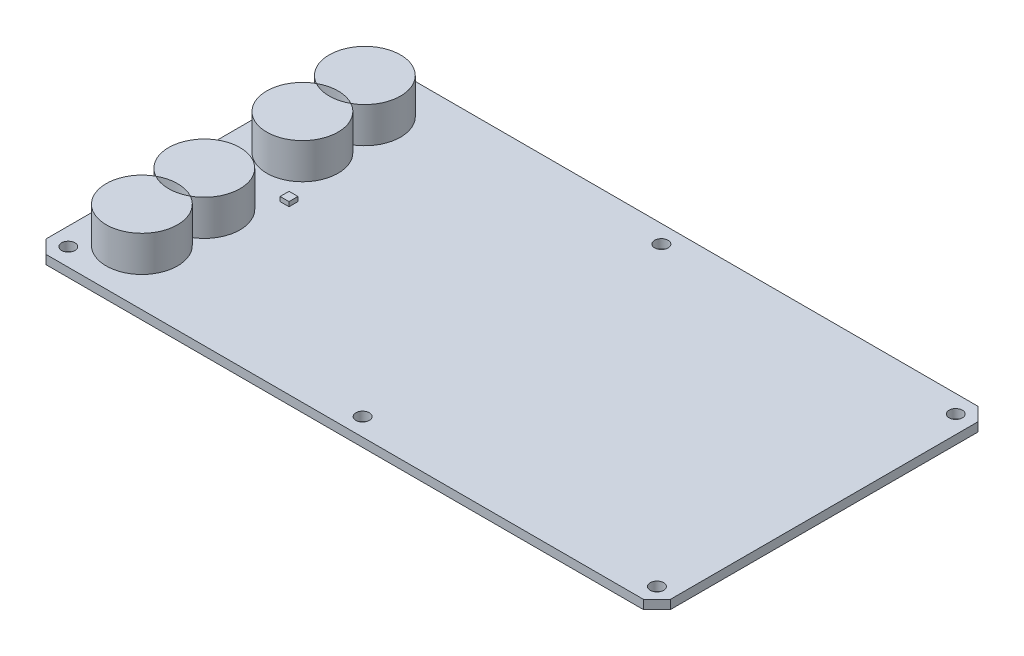
ISO-10303-21;
HEADER;
FILE_DESCRIPTION(('STEP AP214'),'2;1');
FILE_NAME('part.step','',(''),(''),'','','');
FILE_SCHEMA(('AUTOMOTIVE_DESIGN { 1 0 10303 214 1 1 1 1 }'));
ENDSEC;
DATA;
#1=APPLICATION_CONTEXT('core data for automotive mechanical design processes');
#2=APPLICATION_PROTOCOL_DEFINITION('international standard','automotive_design',2000,#1);
#3=PRODUCT_CONTEXT('',#1,'mechanical');
#4=PRODUCT('Part','Part','',(#3));
#5=PRODUCT_RELATED_PRODUCT_CATEGORY('part','',(#4));
#6=PRODUCT_DEFINITION_FORMATION('','',#4);
#7=PRODUCT_DEFINITION_CONTEXT('part definition',#1,'design');
#8=PRODUCT_DEFINITION('design','',#6,#7);
#9=PRODUCT_DEFINITION_SHAPE('','',#8);
#10=(LENGTH_UNIT() NAMED_UNIT(*) SI_UNIT(.MILLI.,.METRE.));
#11=(NAMED_UNIT(*) PLANE_ANGLE_UNIT() SI_UNIT($,.RADIAN.));
#12=(NAMED_UNIT(*) SI_UNIT($,.STERADIAN.) SOLID_ANGLE_UNIT());
#13=UNCERTAINTY_MEASURE_WITH_UNIT(LENGTH_MEASURE(1.E-05),#10,'distance_accuracy_value','');
#14=(GEOMETRIC_REPRESENTATION_CONTEXT(3) GLOBAL_UNCERTAINTY_ASSIGNED_CONTEXT((#13)) GLOBAL_UNIT_ASSIGNED_CONTEXT((#10,
#11,#12)) REPRESENTATION_CONTEXT('',''));
#15=CARTESIAN_POINT('',(0.,0.,0.));
#16=DIRECTION('',(0.,0.,1.));
#17=DIRECTION('',(1.,0.,0.));
#18=AXIS2_PLACEMENT_3D('',#15,#16,#17);
#19=CARTESIAN_POINT('',(0.,2.,0.));
#20=DIRECTION('',(0.,1.,0.));
#21=DIRECTION('',(0.,0.,1.));
#22=AXIS2_PLACEMENT_3D('',#19,#20,#21);
#23=PLANE('',#22);
#24=CARTESIAN_POINT('',(-58.,2.,-11.));
#25=DIRECTION('',(0.,-1.,0.));
#26=DIRECTION('',(0.,0.,-1.));
#27=AXIS2_PLACEMENT_3D('',#24,#25,#26);
#28=CIRCLE('',#27,8.);
#29=CARTESIAN_POINT('',(-54.1270166537926,2.,-18.));
#30=VERTEX_POINT('',#29);
#31=CARTESIAN_POINT('',(-61.8729833462074,2.,-18.));
#32=VERTEX_POINT('',#31);
#33=EDGE_CURVE('P0_E41',#30,#32,#28,.F.);
#34=ORIENTED_EDGE('',*,*,#33,.T.);
#35=CARTESIAN_POINT('',(-58.,2.,-25.));
#36=DIRECTION('',(0.,-1.,0.));
#37=DIRECTION('',(0.,0.,-1.));
#38=AXIS2_PLACEMENT_3D('',#35,#36,#37);
#39=CIRCLE('',#38,8.);
#40=EDGE_CURVE('P0_E20',#30,#32,#39,.F.);
#41=ORIENTED_EDGE('',*,*,#40,.F.);
#42=EDGE_LOOP('',(#34,#41));
#43=FACE_BOUND('',#42,.T.);
#44=ADVANCED_FACE('P0_F17',(#43),#23,.F.);
#45=CARTESIAN_POINT('',(-58.,10.,-25.));
#46=DIRECTION('',(0.,-1.,0.));
#47=DIRECTION('',(0.,0.,-1.));
#48=AXIS2_PLACEMENT_3D('',#45,#46,#47);
#49=CYLINDRICAL_SURFACE('',#48,8.);
#50=ORIENTED_EDGE('',*,*,#40,.T.);
#51=DIRECTION('',(0.,-1.,0.));
#52=VECTOR('',#51,1.);
#53=CARTESIAN_POINT('',(-61.8729833462074,10.,-18.));
#54=LINE('',#53,#52);
#55=CARTESIAN_POINT('',(-61.8729833462074,10.,-18.));
#56=VERTEX_POINT('',#55);
#57=EDGE_CURVE('P0_E49',#32,#56,#54,.F.);
#58=ORIENTED_EDGE('',*,*,#57,.T.);
#59=CARTESIAN_POINT('',(-58.,10.,-25.));
#60=DIRECTION('',(0.,-1.,0.));
#61=DIRECTION('',(0.,0.,-1.));
#62=AXIS2_PLACEMENT_3D('',#59,#60,#61);
#63=CIRCLE('',#62,8.);
#64=CARTESIAN_POINT('',(-54.1270166537926,10.,-18.));
#65=VERTEX_POINT('',#64);
#66=EDGE_CURVE('P0_E11',#65,#56,#63,.F.);
#67=ORIENTED_EDGE('',*,*,#66,.F.);
#68=DIRECTION('',(0.,-1.,0.));
#69=VECTOR('',#68,1.);
#70=CARTESIAN_POINT('',(-54.1270166537926,10.,-18.));
#71=LINE('',#70,#69);
#72=EDGE_CURVE('P0_E46',#65,#30,#71,.T.);
#73=ORIENTED_EDGE('',*,*,#72,.T.);
#74=EDGE_LOOP('',(#50,#58,#67,#73));
#75=FACE_BOUND('',#74,.T.);
#76=ADVANCED_FACE('P0_F50',(#75),#49,.T.);
#77=CARTESIAN_POINT('',(-58.,10.,-11.));
#78=DIRECTION('',(0.,-1.,0.));
#79=DIRECTION('',(0.,0.,-1.));
#80=AXIS2_PLACEMENT_3D('',#77,#78,#79);
#81=CYLINDRICAL_SURFACE('',#80,8.);
#82=CARTESIAN_POINT('',(-58.,10.,-11.));
#83=DIRECTION('',(0.,-1.,0.));
#84=DIRECTION('',(0.,0.,-1.));
#85=AXIS2_PLACEMENT_3D('',#82,#83,#84);
#86=CIRCLE('',#85,8.);
#87=EDGE_CURVE('P0_E26',#56,#65,#86,.T.);
#88=ORIENTED_EDGE('',*,*,#87,.F.);
#89=ORIENTED_EDGE('',*,*,#57,.F.);
#90=ORIENTED_EDGE('',*,*,#33,.F.);
#91=ORIENTED_EDGE('',*,*,#72,.F.);
#92=EDGE_LOOP('',(#88,#89,#90,#91));
#93=FACE_BOUND('',#92,.T.);
#94=ADVANCED_FACE('P0_F47',(#93),#81,.F.);
#95=CARTESIAN_POINT('',(0.,10.,0.));
#96=DIRECTION('',(0.,1.,0.));
#97=DIRECTION('',(0.,0.,1.));
#98=AXIS2_PLACEMENT_3D('',#95,#96,#97);
#99=PLANE('',#98);
#100=ORIENTED_EDGE('',*,*,#66,.T.);
#101=ORIENTED_EDGE('',*,*,#87,.T.);
#102=EDGE_LOOP('',(#100,#101));
#103=FACE_BOUND('',#102,.T.);
#104=ADVANCED_FACE('P0_F55',(#103),#99,.T.);
#105=CLOSED_SHELL('',(#44,#76,#94,#104));
#106=MANIFOLD_SOLID_BREP('P0_B1',#105);
#107=CARTESIAN_POINT('',(0.,2.,0.));
#108=DIRECTION('',(0.,1.,0.));
#109=DIRECTION('',(0.,0.,1.));
#110=AXIS2_PLACEMENT_3D('',#107,#108,#109);
#111=PLANE('',#110);
#112=CARTESIAN_POINT('',(-58.,2.,25.));
#113=DIRECTION('',(0.,-1.,0.));
#114=DIRECTION('',(0.,0.,-1.));
#115=AXIS2_PLACEMENT_3D('',#112,#113,#114);
#116=CIRCLE('',#115,8.);
#117=CARTESIAN_POINT('',(-54.1270166537925,2.,18.));
#118=VERTEX_POINT('',#117);
#119=CARTESIAN_POINT('',(-61.8729833462074,2.,18.));
#120=VERTEX_POINT('',#119);
#121=EDGE_CURVE('P1_E42',#118,#120,#116,.F.);
#122=ORIENTED_EDGE('',*,*,#121,.T.);
#123=CARTESIAN_POINT('',(-58.,2.,11.));
#124=DIRECTION('',(0.,-1.,0.));
#125=DIRECTION('',(0.,0.,-1.));
#126=AXIS2_PLACEMENT_3D('',#123,#124,#125);
#127=CIRCLE('',#126,8.);
#128=EDGE_CURVE('P1_E20',#118,#120,#127,.F.);
#129=ORIENTED_EDGE('',*,*,#128,.F.);
#130=EDGE_LOOP('',(#122,#129));
#131=FACE_BOUND('',#130,.T.);
#132=ADVANCED_FACE('P1_F17',(#131),#111,.F.);
#133=CARTESIAN_POINT('',(-58.,10.,11.));
#134=DIRECTION('',(0.,-1.,0.));
#135=DIRECTION('',(0.,0.,-1.));
#136=AXIS2_PLACEMENT_3D('',#133,#134,#135);
#137=CYLINDRICAL_SURFACE('',#136,8.);
#138=ORIENTED_EDGE('',*,*,#128,.T.);
#139=DIRECTION('',(0.,-1.,0.));
#140=VECTOR('',#139,1.);
#141=CARTESIAN_POINT('',(-61.8729833462074,10.,18.));
#142=LINE('',#141,#140);
#143=CARTESIAN_POINT('',(-61.8729833462074,10.,18.));
#144=VERTEX_POINT('',#143);
#145=EDGE_CURVE('P1_E50',#120,#144,#142,.F.);
#146=ORIENTED_EDGE('',*,*,#145,.T.);
#147=CARTESIAN_POINT('',(-58.,10.,11.));
#148=DIRECTION('',(0.,-1.,0.));
#149=DIRECTION('',(0.,0.,-1.));
#150=AXIS2_PLACEMENT_3D('',#147,#148,#149);
#151=CIRCLE('',#150,8.);
#152=CARTESIAN_POINT('',(-54.1270166537925,10.,18.));
#153=VERTEX_POINT('',#152);
#154=EDGE_CURVE('P1_E11',#153,#144,#151,.F.);
#155=ORIENTED_EDGE('',*,*,#154,.F.);
#156=DIRECTION('',(0.,-1.,0.));
#157=VECTOR('',#156,1.);
#158=CARTESIAN_POINT('',(-54.1270166537925,10.,18.));
#159=LINE('',#158,#157);
#160=EDGE_CURVE('P1_E47',#153,#118,#159,.T.);
#161=ORIENTED_EDGE('',*,*,#160,.T.);
#162=EDGE_LOOP('',(#138,#146,#155,#161));
#163=FACE_BOUND('',#162,.T.);
#164=ADVANCED_FACE('P1_F51',(#163),#137,.T.);
#165=CARTESIAN_POINT('',(-58.,10.,25.));
#166=DIRECTION('',(0.,-1.,0.));
#167=DIRECTION('',(0.,0.,-1.));
#168=AXIS2_PLACEMENT_3D('',#165,#166,#167);
#169=CYLINDRICAL_SURFACE('',#168,8.);
#170=CARTESIAN_POINT('',(-58.,10.,25.));
#171=DIRECTION('',(0.,-1.,0.));
#172=DIRECTION('',(0.,0.,-1.));
#173=AXIS2_PLACEMENT_3D('',#170,#171,#172);
#174=CIRCLE('',#173,8.);
#175=EDGE_CURVE('P1_E27',#144,#153,#174,.T.);
#176=ORIENTED_EDGE('',*,*,#175,.F.);
#177=ORIENTED_EDGE('',*,*,#145,.F.);
#178=ORIENTED_EDGE('',*,*,#121,.F.);
#179=ORIENTED_EDGE('',*,*,#160,.F.);
#180=EDGE_LOOP('',(#176,#177,#178,#179));
#181=FACE_BOUND('',#180,.T.);
#182=ADVANCED_FACE('P1_F48',(#181),#169,.F.);
#183=CARTESIAN_POINT('',(0.,10.,0.));
#184=DIRECTION('',(0.,1.,0.));
#185=DIRECTION('',(0.,0.,1.));
#186=AXIS2_PLACEMENT_3D('',#183,#184,#185);
#187=PLANE('',#186);
#188=ORIENTED_EDGE('',*,*,#154,.T.);
#189=ORIENTED_EDGE('',*,*,#175,.T.);
#190=EDGE_LOOP('',(#188,#189));
#191=FACE_BOUND('',#190,.T.);
#192=ADVANCED_FACE('P1_F56',(#191),#187,.T.);
#193=CLOSED_SHELL('',(#132,#164,#182,#192));
#194=MANIFOLD_SOLID_BREP('P1_B1',#193);
#195=CARTESIAN_POINT('',(0.,2.,0.));
#196=DIRECTION('',(0.,-1.,0.));
#197=DIRECTION('',(0.,0.,-1.));
#198=AXIS2_PLACEMENT_3D('',#195,#196,#197);
#199=PLANE('',#198);
#200=DIRECTION('',(0.,0.,-1.));
#201=VECTOR('',#200,1.);
#202=CARTESIAN_POINT('',(-51.,2.,0.999999999999998));
#203=LINE('',#202,#201);
#204=CARTESIAN_POINT('',(-51.,2.,0.999999999999998));
#205=VERTEX_POINT('',#204);
#206=CARTESIAN_POINT('',(-51.,2.,-0.999999999999967));
#207=VERTEX_POINT('',#206);
#208=EDGE_CURVE('P2_E55',#205,#207,#203,.T.);
#209=ORIENTED_EDGE('',*,*,#208,.T.);
#210=DIRECTION('',(1.,0.,0.));
#211=VECTOR('',#210,1.);
#212=CARTESIAN_POINT('',(-51.,2.,-0.999999999999967));
#213=LINE('',#212,#211);
#214=CARTESIAN_POINT('',(-49.,2.,-0.999999999999967));
#215=VERTEX_POINT('',#214);
#216=EDGE_CURVE('P2_E76',#207,#215,#213,.T.);
#217=ORIENTED_EDGE('',*,*,#216,.T.);
#218=DIRECTION('',(0.,0.,1.));
#219=VECTOR('',#218,1.);
#220=CARTESIAN_POINT('',(-49.,2.,0.999999999999998));
#221=LINE('',#220,#219);
#222=CARTESIAN_POINT('',(-49.,2.,0.999999999999998));
#223=VERTEX_POINT('',#222);
#224=EDGE_CURVE('P2_E58',#215,#223,#221,.T.);
#225=ORIENTED_EDGE('',*,*,#224,.T.);
#226=DIRECTION('',(-1.,0.,0.));
#227=VECTOR('',#226,1.);
#228=CARTESIAN_POINT('',(-51.,2.,0.999999999999998));
#229=LINE('',#228,#227);
#230=EDGE_CURVE('P2_E20',#223,#205,#229,.T.);
#231=ORIENTED_EDGE('',*,*,#230,.T.);
#232=EDGE_LOOP('',(#209,#217,#225,#231));
#233=FACE_BOUND('',#232,.T.);
#234=ADVANCED_FACE('P2_F17',(#233),#199,.T.);
#235=CARTESIAN_POINT('',(-51.,3.,0.999999999999998));
#236=DIRECTION('',(0.,0.,-1.));
#237=DIRECTION('',(-1.,0.,0.));
#238=AXIS2_PLACEMENT_3D('',#235,#236,#237);
#239=PLANE('',#238);
#240=DIRECTION('',(0.,1.,0.));
#241=VECTOR('',#240,1.);
#242=CARTESIAN_POINT('',(-49.,3.,0.999999999999998));
#243=LINE('',#242,#241);
#244=CARTESIAN_POINT('',(-49.,3.,0.999999999999998));
#245=VERTEX_POINT('',#244);
#246=EDGE_CURVE('P2_E78',#223,#245,#243,.T.);
#247=ORIENTED_EDGE('',*,*,#246,.T.);
#248=DIRECTION('',(1.,0.,0.));
#249=VECTOR('',#248,1.);
#250=CARTESIAN_POINT('',(0.,3.,0.999999999999998));
#251=LINE('',#250,#249);
#252=CARTESIAN_POINT('',(-51.,3.,0.999999999999998));
#253=VERTEX_POINT('',#252);
#254=EDGE_CURVE('P2_E73',#245,#253,#251,.F.);
#255=ORIENTED_EDGE('',*,*,#254,.T.);
#256=DIRECTION('',(0.,1.,0.));
#257=VECTOR('',#256,1.);
#258=CARTESIAN_POINT('',(-51.,3.,0.999999999999998));
#259=LINE('',#258,#257);
#260=EDGE_CURVE('P2_E63',#253,#205,#259,.F.);
#261=ORIENTED_EDGE('',*,*,#260,.T.);
#262=ORIENTED_EDGE('',*,*,#230,.F.);
#263=EDGE_LOOP('',(#247,#255,#261,#262));
#264=FACE_BOUND('',#263,.T.);
#265=ADVANCED_FACE('P2_F72',(#264),#239,.F.);
#266=CARTESIAN_POINT('',(-51.,3.,0.999999999999998));
#267=DIRECTION('',(1.,0.,0.));
#268=DIRECTION('',(0.,0.,-1.));
#269=AXIS2_PLACEMENT_3D('',#266,#267,#268);
#270=PLANE('',#269);
#271=ORIENTED_EDGE('',*,*,#260,.F.);
#272=DIRECTION('',(0.,0.,-1.));
#273=VECTOR('',#272,1.);
#274=CARTESIAN_POINT('',(-51.,3.,0.));
#275=LINE('',#274,#273);
#276=CARTESIAN_POINT('',(-51.,3.,-0.999999999999967));
#277=VERTEX_POINT('',#276);
#278=EDGE_CURVE('P2_E83',#253,#277,#275,.T.);
#279=ORIENTED_EDGE('',*,*,#278,.T.);
#280=DIRECTION('',(0.,1.,0.));
#281=VECTOR('',#280,1.);
#282=CARTESIAN_POINT('',(-51.,3.,-0.999999999999967));
#283=LINE('',#282,#281);
#284=EDGE_CURVE('P2_E69',#277,#207,#283,.F.);
#285=ORIENTED_EDGE('',*,*,#284,.T.);
#286=ORIENTED_EDGE('',*,*,#208,.F.);
#287=EDGE_LOOP('',(#271,#279,#285,#286));
#288=FACE_BOUND('',#287,.T.);
#289=ADVANCED_FACE('P2_F66',(#288),#270,.F.);
#290=CARTESIAN_POINT('',(-51.,3.,-0.999999999999967));
#291=DIRECTION('',(0.,0.,1.));
#292=DIRECTION('',(1.,0.,0.));
#293=AXIS2_PLACEMENT_3D('',#290,#291,#292);
#294=PLANE('',#293);
#295=ORIENTED_EDGE('',*,*,#284,.F.);
#296=DIRECTION('',(1.,0.,0.));
#297=VECTOR('',#296,1.);
#298=CARTESIAN_POINT('',(0.,3.,-0.999999999999967));
#299=LINE('',#298,#297);
#300=CARTESIAN_POINT('',(-49.,3.,-0.999999999999967));
#301=VERTEX_POINT('',#300);
#302=EDGE_CURVE('P2_E26',#277,#301,#299,.T.);
#303=ORIENTED_EDGE('',*,*,#302,.T.);
#304=DIRECTION('',(0.,1.,0.));
#305=VECTOR('',#304,1.);
#306=CARTESIAN_POINT('',(-49.,3.,-0.999999999999967));
#307=LINE('',#306,#305);
#308=EDGE_CURVE('P2_E34',#301,#215,#307,.F.);
#309=ORIENTED_EDGE('',*,*,#308,.T.);
#310=ORIENTED_EDGE('',*,*,#216,.F.);
#311=EDGE_LOOP('',(#295,#303,#309,#310));
#312=FACE_BOUND('',#311,.T.);
#313=ADVANCED_FACE('P2_F88',(#312),#294,.F.);
#314=CARTESIAN_POINT('',(-49.,3.,0.999999999999998));
#315=DIRECTION('',(-1.,0.,0.));
#316=DIRECTION('',(0.,0.,1.));
#317=AXIS2_PLACEMENT_3D('',#314,#315,#316);
#318=PLANE('',#317);
#319=ORIENTED_EDGE('',*,*,#308,.F.);
#320=DIRECTION('',(0.,0.,-1.));
#321=VECTOR('',#320,1.);
#322=CARTESIAN_POINT('',(-49.,3.,0.));
#323=LINE('',#322,#321);
#324=EDGE_CURVE('P2_E10',#301,#245,#323,.F.);
#325=ORIENTED_EDGE('',*,*,#324,.T.);
#326=ORIENTED_EDGE('',*,*,#246,.F.);
#327=ORIENTED_EDGE('',*,*,#224,.F.);
#328=EDGE_LOOP('',(#319,#325,#326,#327));
#329=FACE_BOUND('',#328,.T.);
#330=ADVANCED_FACE('P2_F91',(#329),#318,.F.);
#331=CARTESIAN_POINT('',(0.,3.,0.));
#332=DIRECTION('',(0.,-1.,0.));
#333=DIRECTION('',(0.,0.,-1.));
#334=AXIS2_PLACEMENT_3D('',#331,#332,#333);
#335=PLANE('',#334);
#336=ORIENTED_EDGE('',*,*,#302,.F.);
#337=ORIENTED_EDGE('',*,*,#278,.F.);
#338=ORIENTED_EDGE('',*,*,#254,.F.);
#339=ORIENTED_EDGE('',*,*,#324,.F.);
#340=EDGE_LOOP('',(#336,#337,#338,#339));
#341=FACE_BOUND('',#340,.T.);
#342=ADVANCED_FACE('P2_F90',(#341),#335,.F.);
#343=CLOSED_SHELL('',(#234,#265,#289,#313,#330,#342));
#344=MANIFOLD_SOLID_BREP('P2_B1',#343);
#345=CARTESIAN_POINT('',(0.,0.,0.));
#346=DIRECTION('',(0.,1.,0.));
#347=DIRECTION('',(0.,0.,1.));
#348=AXIS2_PLACEMENT_3D('',#345,#346,#347);
#349=PLANE('',#348);
#350=CARTESIAN_POINT('',(0.,0.,33.5));
#351=DIRECTION('',(0.,-1.,0.));
#352=DIRECTION('',(0.,0.,-1.));
#353=AXIS2_PLACEMENT_3D('',#350,#351,#352);
#354=CIRCLE('',#353,1.5);
#355=CARTESIAN_POINT('',(0.,0.,32.));
#356=VERTEX_POINT('',#355);
#357=EDGE_CURVE('P3_E122',#356,#356,#354,.F.);
#358=ORIENTED_EDGE('',*,*,#357,.T.);
#359=EDGE_LOOP('',(#358));
#360=FACE_BOUND('',#359,.T.);
#361=CARTESIAN_POINT('',(0.,0.,-33.5));
#362=DIRECTION('',(0.,-1.,0.));
#363=DIRECTION('',(0.,0.,-1.));
#364=AXIS2_PLACEMENT_3D('',#361,#362,#363);
#365=CIRCLE('',#364,1.5);
#366=CARTESIAN_POINT('',(0.,0.,-35.));
#367=VERTEX_POINT('',#366);
#368=EDGE_CURVE('P3_E19',#367,#367,#365,.F.);
#369=ORIENTED_EDGE('',*,*,#368,.T.);
#370=EDGE_LOOP('',(#369));
#371=FACE_BOUND('',#370,.T.);
#372=CARTESIAN_POINT('',(66.,0.,33.5));
#373=DIRECTION('',(0.,-1.,0.));
#374=DIRECTION('',(0.,0.,-1.));
#375=AXIS2_PLACEMENT_3D('',#372,#373,#374);
#376=CIRCLE('',#375,1.49999999999999);
#377=CARTESIAN_POINT('',(66.,0.,32.));
#378=VERTEX_POINT('',#377);
#379=EDGE_CURVE('P3_E125',#378,#378,#376,.F.);
#380=ORIENTED_EDGE('',*,*,#379,.T.);
#381=EDGE_LOOP('',(#380));
#382=FACE_BOUND('',#381,.T.);
#383=CARTESIAN_POINT('',(66.,0.,-33.5));
#384=DIRECTION('',(0.,-1.,0.));
#385=DIRECTION('',(0.,0.,-1.));
#386=AXIS2_PLACEMENT_3D('',#383,#384,#385);
#387=CIRCLE('',#386,1.49999999999999);
#388=CARTESIAN_POINT('',(66.,0.,-35.));
#389=VERTEX_POINT('',#388);
#390=EDGE_CURVE('P3_E133',#389,#389,#387,.F.);
#391=ORIENTED_EDGE('',*,*,#390,.T.);
#392=EDGE_LOOP('',(#391));
#393=FACE_BOUND('',#392,.T.);
#394=CARTESIAN_POINT('',(-66.,0.,-33.5));
#395=DIRECTION('',(0.,-1.,0.));
#396=DIRECTION('',(0.,0.,-1.));
#397=AXIS2_PLACEMENT_3D('',#394,#395,#396);
#398=CIRCLE('',#397,1.49999999999999);
#399=CARTESIAN_POINT('',(-66.,0.,-35.));
#400=VERTEX_POINT('',#399);
#401=EDGE_CURVE('P3_E128',#400,#400,#398,.F.);
#402=ORIENTED_EDGE('',*,*,#401,.T.);
#403=EDGE_LOOP('',(#402));
#404=FACE_BOUND('',#403,.T.);
#405=CARTESIAN_POINT('',(-66.,0.,33.5));
#406=DIRECTION('',(0.,-1.,0.));
#407=DIRECTION('',(0.,0.,-1.));
#408=AXIS2_PLACEMENT_3D('',#405,#406,#407);
#409=CIRCLE('',#408,1.49999999999999);
#410=CARTESIAN_POINT('',(-66.,0.,32.));
#411=VERTEX_POINT('',#410);
#412=EDGE_CURVE('P3_E92',#411,#411,#409,.F.);
#413=ORIENTED_EDGE('',*,*,#412,.T.);
#414=EDGE_LOOP('',(#413));
#415=FACE_BOUND('',#414,.T.);
#416=DIRECTION('',(0.707106781186548,0.,0.707106781186548));
#417=VECTOR('',#416,1.);
#418=CARTESIAN_POINT('',(70.,0.,-34.5));
#419=LINE('',#418,#417);
#420=CARTESIAN_POINT('',(67.,0.,-37.5));
#421=VERTEX_POINT('',#420);
#422=CARTESIAN_POINT('',(70.,0.,-34.5));
#423=VERTEX_POINT('',#422);
#424=EDGE_CURVE('P3_E131',#421,#423,#419,.T.);
#425=ORIENTED_EDGE('',*,*,#424,.T.);
#426=DIRECTION('',(0.,0.,1.));
#427=VECTOR('',#426,1.);
#428=CARTESIAN_POINT('',(70.,0.,34.5));
#429=LINE('',#428,#427);
#430=CARTESIAN_POINT('',(70.,0.,34.5));
#431=VERTEX_POINT('',#430);
#432=EDGE_CURVE('P3_E408',#423,#431,#429,.T.);
#433=ORIENTED_EDGE('',*,*,#432,.T.);
#434=DIRECTION('',(-0.707106781186548,0.,0.707106781186548));
#435=VECTOR('',#434,1.);
#436=CARTESIAN_POINT('',(67.,0.,37.5));
#437=LINE('',#436,#435);
#438=CARTESIAN_POINT('',(67.,0.,37.5));
#439=VERTEX_POINT('',#438);
#440=EDGE_CURVE('P3_E413',#431,#439,#437,.T.);
#441=ORIENTED_EDGE('',*,*,#440,.T.);
#442=DIRECTION('',(-1.,0.,0.));
#443=VECTOR('',#442,1.);
#444=CARTESIAN_POINT('',(-67.,0.,37.5));
#445=LINE('',#444,#443);
#446=CARTESIAN_POINT('',(-67.,0.,37.5));
#447=VERTEX_POINT('',#446);
#448=EDGE_CURVE('P3_E418',#439,#447,#445,.T.);
#449=ORIENTED_EDGE('',*,*,#448,.T.);
#450=DIRECTION('',(-0.707106781186548,0.,-0.707106781186548));
#451=VECTOR('',#450,1.);
#452=CARTESIAN_POINT('',(-67.,0.,37.5));
#453=LINE('',#452,#451);
#454=CARTESIAN_POINT('',(-70.,0.,34.5));
#455=VERTEX_POINT('',#454);
#456=EDGE_CURVE('P3_E388',#447,#455,#453,.T.);
#457=ORIENTED_EDGE('',*,*,#456,.T.);
#458=DIRECTION('',(0.,0.,-1.));
#459=VECTOR('',#458,1.);
#460=CARTESIAN_POINT('',(-70.,0.,34.5));
#461=LINE('',#460,#459);
#462=CARTESIAN_POINT('',(-70.,0.,-34.5));
#463=VERTEX_POINT('',#462);
#464=EDGE_CURVE('P3_E95',#455,#463,#461,.T.);
#465=ORIENTED_EDGE('',*,*,#464,.T.);
#466=DIRECTION('',(0.707106781186548,0.,-0.707106781186548));
#467=VECTOR('',#466,1.);
#468=CARTESIAN_POINT('',(-70.,0.,-34.5));
#469=LINE('',#468,#467);
#470=CARTESIAN_POINT('',(-67.,0.,-37.5));
#471=VERTEX_POINT('',#470);
#472=EDGE_CURVE('P3_E78',#463,#471,#469,.T.);
#473=ORIENTED_EDGE('',*,*,#472,.T.);
#474=DIRECTION('',(1.,0.,0.));
#475=VECTOR('',#474,1.);
#476=CARTESIAN_POINT('',(-67.,0.,-37.5));
#477=LINE('',#476,#475);
#478=EDGE_CURVE('P3_E83',#471,#421,#477,.T.);
#479=ORIENTED_EDGE('',*,*,#478,.T.);
#480=EDGE_LOOP('',(#425,#433,#441,#449,#457,#465,#473,#479));
#481=FACE_BOUND('',#480,.T.);
#482=ADVANCED_FACE('P3_F16',(#360,#371,#382,#393,#404,#415,#481),#349,.F.);
#483=CARTESIAN_POINT('',(0.,2.,-33.5));
#484=DIRECTION('',(0.,-1.,0.));
#485=DIRECTION('',(0.,0.,-1.));
#486=AXIS2_PLACEMENT_3D('',#483,#484,#485);
#487=CYLINDRICAL_SURFACE('',#486,1.5);
#488=CARTESIAN_POINT('',(0.,2.,-33.5));
#489=DIRECTION('',(0.,-1.,0.));
#490=DIRECTION('',(0.,0.,-1.));
#491=AXIS2_PLACEMENT_3D('',#488,#489,#490);
#492=CIRCLE('',#491,1.5);
#493=CARTESIAN_POINT('',(0.,2.,-35.));
#494=VERTEX_POINT('',#493);
#495=EDGE_CURVE('P3_E119',#494,#494,#492,.T.);
#496=ORIENTED_EDGE('',*,*,#495,.F.);
#497=EDGE_LOOP('',(#496));
#498=FACE_BOUND('',#497,.T.);
#499=ORIENTED_EDGE('',*,*,#368,.F.);
#500=EDGE_LOOP('',(#499));
#501=FACE_BOUND('',#500,.T.);
#502=ADVANCED_FACE('P3_F142',(#498,#501),#487,.F.);
#503=CARTESIAN_POINT('',(66.,2.,-33.5));
#504=DIRECTION('',(0.,-1.,0.));
#505=DIRECTION('',(0.,0.,-1.));
#506=AXIS2_PLACEMENT_3D('',#503,#504,#505);
#507=CYLINDRICAL_SURFACE('',#506,1.49999999999999);
#508=CARTESIAN_POINT('',(66.,2.,-33.5));
#509=DIRECTION('',(0.,-1.,0.));
#510=DIRECTION('',(0.,0.,-1.));
#511=AXIS2_PLACEMENT_3D('',#508,#509,#510);
#512=CIRCLE('',#511,1.49999999999999);
#513=CARTESIAN_POINT('',(66.,2.,-35.));
#514=VERTEX_POINT('',#513);
#515=EDGE_CURVE('P3_E116',#514,#514,#512,.T.);
#516=ORIENTED_EDGE('',*,*,#515,.F.);
#517=EDGE_LOOP('',(#516));
#518=FACE_BOUND('',#517,.T.);
#519=ORIENTED_EDGE('',*,*,#390,.F.);
#520=EDGE_LOOP('',(#519));
#521=FACE_BOUND('',#520,.T.);
#522=ADVANCED_FACE('P3_F144',(#518,#521),#507,.F.);
#523=CARTESIAN_POINT('',(-66.,2.,33.5));
#524=DIRECTION('',(0.,-1.,0.));
#525=DIRECTION('',(0.,0.,-1.));
#526=AXIS2_PLACEMENT_3D('',#523,#524,#525);
#527=CYLINDRICAL_SURFACE('',#526,1.49999999999999);
#528=CARTESIAN_POINT('',(-66.,2.,33.5));
#529=DIRECTION('',(0.,-1.,0.));
#530=DIRECTION('',(0.,0.,-1.));
#531=AXIS2_PLACEMENT_3D('',#528,#529,#530);
#532=CIRCLE('',#531,1.49999999999999);
#533=CARTESIAN_POINT('',(-66.,2.,32.));
#534=VERTEX_POINT('',#533);
#535=EDGE_CURVE('P3_E112',#534,#534,#532,.T.);
#536=ORIENTED_EDGE('',*,*,#535,.F.);
#537=EDGE_LOOP('',(#536));
#538=FACE_BOUND('',#537,.T.);
#539=ORIENTED_EDGE('',*,*,#412,.F.);
#540=EDGE_LOOP('',(#539));
#541=FACE_BOUND('',#540,.T.);
#542=ADVANCED_FACE('P3_F151',(#538,#541),#527,.F.);
#543=CARTESIAN_POINT('',(-67.,2.,-37.5));
#544=DIRECTION('',(0.,0.,1.));
#545=DIRECTION('',(1.,0.,0.));
#546=AXIS2_PLACEMENT_3D('',#543,#544,#545);
#547=PLANE('',#546);
#548=DIRECTION('',(0.,1.,0.));
#549=VECTOR('',#548,1.);
#550=CARTESIAN_POINT('',(-67.,2.,-37.5));
#551=LINE('',#550,#549);
#552=CARTESIAN_POINT('',(-67.,2.,-37.5));
#553=VERTEX_POINT('',#552);
#554=EDGE_CURVE('P3_E85',#471,#553,#551,.T.);
#555=ORIENTED_EDGE('',*,*,#554,.T.);
#556=DIRECTION('',(1.,0.,0.));
#557=VECTOR('',#556,1.);
#558=CARTESIAN_POINT('',(0.,2.,-37.5));
#559=LINE('',#558,#557);
#560=CARTESIAN_POINT('',(67.,2.,-37.5));
#561=VERTEX_POINT('',#560);
#562=EDGE_CURVE('P3_E115',#561,#553,#559,.F.);
#563=ORIENTED_EDGE('',*,*,#562,.F.);
#564=DIRECTION('',(0.,1.,0.));
#565=VECTOR('',#564,1.);
#566=CARTESIAN_POINT('',(67.,2.,-37.5));
#567=LINE('',#566,#565);
#568=EDGE_CURVE('P3_E88',#561,#421,#567,.F.);
#569=ORIENTED_EDGE('',*,*,#568,.T.);
#570=ORIENTED_EDGE('',*,*,#478,.F.);
#571=EDGE_LOOP('',(#555,#563,#569,#570));
#572=FACE_BOUND('',#571,.T.);
#573=ADVANCED_FACE('P3_F84',(#572),#547,.F.);
#574=CARTESIAN_POINT('',(-70.,2.,-34.5));
#575=DIRECTION('',(0.707106781186548,0.,0.707106781186548));
#576=DIRECTION('',(0.707106781186548,0.,-0.707106781186548));
#577=AXIS2_PLACEMENT_3D('',#574,#575,#576);
#578=PLANE('',#577);
#579=DIRECTION('',(0.,1.,0.));
#580=VECTOR('',#579,1.);
#581=CARTESIAN_POINT('',(-70.,2.,-34.5));
#582=LINE('',#581,#580);
#583=CARTESIAN_POINT('',(-70.,2.,-34.5));
#584=VERTEX_POINT('',#583);
#585=EDGE_CURVE('P3_E97',#463,#584,#582,.T.);
#586=ORIENTED_EDGE('',*,*,#585,.T.);
#587=DIRECTION('',(-0.707106781186549,0.,0.707106781186546));
#588=VECTOR('',#587,1.);
#589=CARTESIAN_POINT('',(-67.,2.,-37.5));
#590=LINE('',#589,#588);
#591=EDGE_CURVE('P3_E101',#553,#584,#590,.T.);
#592=ORIENTED_EDGE('',*,*,#591,.F.);
#593=ORIENTED_EDGE('',*,*,#554,.F.);
#594=ORIENTED_EDGE('',*,*,#472,.F.);
#595=EDGE_LOOP('',(#586,#592,#593,#594));
#596=FACE_BOUND('',#595,.T.);
#597=ADVANCED_FACE('P3_F99',(#596),#578,.F.);
#598=CARTESIAN_POINT('',(-70.,2.,34.5));
#599=DIRECTION('',(1.,0.,0.));
#600=DIRECTION('',(0.,0.,-1.));
#601=AXIS2_PLACEMENT_3D('',#598,#599,#600);
#602=PLANE('',#601);
#603=DIRECTION('',(0.,1.,0.));
#604=VECTOR('',#603,1.);
#605=CARTESIAN_POINT('',(-70.,2.,34.5));
#606=LINE('',#605,#604);
#607=CARTESIAN_POINT('',(-70.,2.,34.5));
#608=VERTEX_POINT('',#607);
#609=EDGE_CURVE('P3_E384',#455,#608,#606,.T.);
#610=ORIENTED_EDGE('',*,*,#609,.T.);
#611=DIRECTION('',(0.,0.,1.));
#612=VECTOR('',#611,1.);
#613=CARTESIAN_POINT('',(-70.,2.,0.));
#614=LINE('',#613,#612);
#615=EDGE_CURVE('P3_E387',#584,#608,#614,.T.);
#616=ORIENTED_EDGE('',*,*,#615,.F.);
#617=ORIENTED_EDGE('',*,*,#585,.F.);
#618=ORIENTED_EDGE('',*,*,#464,.F.);
#619=EDGE_LOOP('',(#610,#616,#617,#618));
#620=FACE_BOUND('',#619,.T.);
#621=ADVANCED_FACE('P3_F194',(#620),#602,.F.);
#622=CARTESIAN_POINT('',(-67.,2.,37.5));
#623=DIRECTION('',(0.707106781186548,0.,-0.707106781186548));
#624=DIRECTION('',(-0.707106781186548,0.,-0.707106781186548));
#625=AXIS2_PLACEMENT_3D('',#622,#623,#624);
#626=PLANE('',#625);
#627=DIRECTION('',(0.,1.,0.));
#628=VECTOR('',#627,1.);
#629=CARTESIAN_POINT('',(-67.,2.,37.5));
#630=LINE('',#629,#628);
#631=CARTESIAN_POINT('',(-67.,2.,37.5));
#632=VERTEX_POINT('',#631);
#633=EDGE_CURVE('P3_E393',#447,#632,#630,.T.);
#634=ORIENTED_EDGE('',*,*,#633,.T.);
#635=DIRECTION('',(0.707106781186549,0.,0.707106781186546));
#636=VECTOR('',#635,1.);
#637=CARTESIAN_POINT('',(-70.,2.,34.5));
#638=LINE('',#637,#636);
#639=EDGE_CURVE('P3_E391',#608,#632,#638,.T.);
#640=ORIENTED_EDGE('',*,*,#639,.F.);
#641=ORIENTED_EDGE('',*,*,#609,.F.);
#642=ORIENTED_EDGE('',*,*,#456,.F.);
#643=EDGE_LOOP('',(#634,#640,#641,#642));
#644=FACE_BOUND('',#643,.T.);
#645=ADVANCED_FACE('P3_F190',(#644),#626,.F.);
#646=CARTESIAN_POINT('',(-67.,2.,37.5));
#647=DIRECTION('',(0.,0.,-1.));
#648=DIRECTION('',(-1.,0.,0.));
#649=AXIS2_PLACEMENT_3D('',#646,#647,#648);
#650=PLANE('',#649);
#651=DIRECTION('',(0.,1.,0.));
#652=VECTOR('',#651,1.);
#653=CARTESIAN_POINT('',(67.,2.,37.5));
#654=LINE('',#653,#652);
#655=CARTESIAN_POINT('',(67.,2.,37.5));
#656=VERTEX_POINT('',#655);
#657=EDGE_CURVE('P3_E416',#439,#656,#654,.T.);
#658=ORIENTED_EDGE('',*,*,#657,.T.);
#659=DIRECTION('',(1.,0.,0.));
#660=VECTOR('',#659,1.);
#661=CARTESIAN_POINT('',(0.,2.,37.5));
#662=LINE('',#661,#660);
#663=EDGE_CURVE('P3_E397',#632,#656,#662,.T.);
#664=ORIENTED_EDGE('',*,*,#663,.F.);
#665=ORIENTED_EDGE('',*,*,#633,.F.);
#666=ORIENTED_EDGE('',*,*,#448,.F.);
#667=EDGE_LOOP('',(#658,#664,#665,#666));
#668=FACE_BOUND('',#667,.T.);
#669=ADVANCED_FACE('P3_F186',(#668),#650,.F.);
#670=CARTESIAN_POINT('',(67.,2.,37.5));
#671=DIRECTION('',(-0.707106781186548,0.,-0.707106781186548));
#672=DIRECTION('',(-0.707106781186548,0.,0.707106781186548));
#673=AXIS2_PLACEMENT_3D('',#670,#671,#672);
#674=PLANE('',#673);
#675=DIRECTION('',(0.,1.,0.));
#676=VECTOR('',#675,1.);
#677=CARTESIAN_POINT('',(70.,2.,34.5));
#678=LINE('',#677,#676);
#679=CARTESIAN_POINT('',(70.,2.,34.5));
#680=VERTEX_POINT('',#679);
#681=EDGE_CURVE('P3_E411',#431,#680,#678,.T.);
#682=ORIENTED_EDGE('',*,*,#681,.T.);
#683=DIRECTION('',(0.707106781186547,0.,-0.707106781186547));
#684=VECTOR('',#683,1.);
#685=CARTESIAN_POINT('',(67.,2.,37.5));
#686=LINE('',#685,#684);
#687=EDGE_CURVE('P3_E426',#656,#680,#686,.T.);
#688=ORIENTED_EDGE('',*,*,#687,.F.);
#689=ORIENTED_EDGE('',*,*,#657,.F.);
#690=ORIENTED_EDGE('',*,*,#440,.F.);
#691=EDGE_LOOP('',(#682,#688,#689,#690));
#692=FACE_BOUND('',#691,.T.);
#693=ADVANCED_FACE('P3_F183',(#692),#674,.F.);
#694=CARTESIAN_POINT('',(70.,2.,34.5));
#695=DIRECTION('',(-1.,0.,0.));
#696=DIRECTION('',(0.,0.,1.));
#697=AXIS2_PLACEMENT_3D('',#694,#695,#696);
#698=PLANE('',#697);
#699=DIRECTION('',(0.,1.,0.));
#700=VECTOR('',#699,1.);
#701=CARTESIAN_POINT('',(70.,2.,-34.5));
#702=LINE('',#701,#700);
#703=CARTESIAN_POINT('',(70.,2.,-34.5));
#704=VERTEX_POINT('',#703);
#705=EDGE_CURVE('P3_E34',#423,#704,#702,.T.);
#706=ORIENTED_EDGE('',*,*,#705,.T.);
#707=DIRECTION('',(0.,0.,1.));
#708=VECTOR('',#707,1.);
#709=CARTESIAN_POINT('',(70.,2.,0.));
#710=LINE('',#709,#708);
#711=EDGE_CURVE('P3_E427',#680,#704,#710,.F.);
#712=ORIENTED_EDGE('',*,*,#711,.F.);
#713=ORIENTED_EDGE('',*,*,#681,.F.);
#714=ORIENTED_EDGE('',*,*,#432,.F.);
#715=EDGE_LOOP('',(#706,#712,#713,#714));
#716=FACE_BOUND('',#715,.T.);
#717=ADVANCED_FACE('P3_F179',(#716),#698,.F.);
#718=CARTESIAN_POINT('',(70.,2.,-34.5));
#719=DIRECTION('',(-0.707106781186548,0.,0.707106781186548));
#720=DIRECTION('',(0.707106781186548,0.,0.707106781186548));
#721=AXIS2_PLACEMENT_3D('',#718,#719,#720);
#722=PLANE('',#721);
#723=ORIENTED_EDGE('',*,*,#568,.F.);
#724=DIRECTION('',(-0.707106781186547,0.,-0.707106781186547));
#725=VECTOR('',#724,1.);
#726=CARTESIAN_POINT('',(70.,2.,-34.5));
#727=LINE('',#726,#725);
#728=EDGE_CURVE('P3_E111',#704,#561,#727,.T.);
#729=ORIENTED_EDGE('',*,*,#728,.F.);
#730=ORIENTED_EDGE('',*,*,#705,.F.);
#731=ORIENTED_EDGE('',*,*,#424,.F.);
#732=EDGE_LOOP('',(#723,#729,#730,#731));
#733=FACE_BOUND('',#732,.T.);
#734=ADVANCED_FACE('P3_F175',(#733),#722,.F.);
#735=CARTESIAN_POINT('',(-66.,2.,-33.5));
#736=DIRECTION('',(0.,-1.,0.));
#737=DIRECTION('',(0.,0.,-1.));
#738=AXIS2_PLACEMENT_3D('',#735,#736,#737);
#739=CYLINDRICAL_SURFACE('',#738,1.49999999999999);
#740=CARTESIAN_POINT('',(-66.,2.,-33.5));
#741=DIRECTION('',(0.,-1.,0.));
#742=DIRECTION('',(0.,0.,-1.));
#743=AXIS2_PLACEMENT_3D('',#740,#741,#742);
#744=CIRCLE('',#743,1.49999999999999);
#745=CARTESIAN_POINT('',(-66.,2.,-35.));
#746=VERTEX_POINT('',#745);
#747=EDGE_CURVE('P3_E108',#746,#746,#744,.T.);
#748=ORIENTED_EDGE('',*,*,#747,.F.);
#749=EDGE_LOOP('',(#748));
#750=FACE_BOUND('',#749,.T.);
#751=ORIENTED_EDGE('',*,*,#401,.F.);
#752=EDGE_LOOP('',(#751));
#753=FACE_BOUND('',#752,.T.);
#754=ADVANCED_FACE('P3_F171',(#750,#753),#739,.F.);
#755=CARTESIAN_POINT('',(66.,2.,33.5));
#756=DIRECTION('',(0.,-1.,0.));
#757=DIRECTION('',(0.,0.,-1.));
#758=AXIS2_PLACEMENT_3D('',#755,#756,#757);
#759=CYLINDRICAL_SURFACE('',#758,1.49999999999999);
#760=CARTESIAN_POINT('',(66.,2.,33.5));
#761=DIRECTION('',(0.,-1.,0.));
#762=DIRECTION('',(0.,0.,-1.));
#763=AXIS2_PLACEMENT_3D('',#760,#761,#762);
#764=CIRCLE('',#763,1.49999999999999);
#765=CARTESIAN_POINT('',(66.,2.,32.));
#766=VERTEX_POINT('',#765);
#767=EDGE_CURVE('P3_E25',#766,#766,#764,.T.);
#768=ORIENTED_EDGE('',*,*,#767,.F.);
#769=EDGE_LOOP('',(#768));
#770=FACE_BOUND('',#769,.T.);
#771=ORIENTED_EDGE('',*,*,#379,.F.);
#772=EDGE_LOOP('',(#771));
#773=FACE_BOUND('',#772,.T.);
#774=ADVANCED_FACE('P3_F164',(#770,#773),#759,.F.);
#775=CARTESIAN_POINT('',(0.,2.,33.5));
#776=DIRECTION('',(0.,-1.,0.));
#777=DIRECTION('',(0.,0.,-1.));
#778=AXIS2_PLACEMENT_3D('',#775,#776,#777);
#779=CYLINDRICAL_SURFACE('',#778,1.5);
#780=CARTESIAN_POINT('',(0.,2.,33.5));
#781=DIRECTION('',(0.,-1.,0.));
#782=DIRECTION('',(0.,0.,-1.));
#783=AXIS2_PLACEMENT_3D('',#780,#781,#782);
#784=CIRCLE('',#783,1.5);
#785=CARTESIAN_POINT('',(0.,2.,32.));
#786=VERTEX_POINT('',#785);
#787=EDGE_CURVE('P3_E10',#786,#786,#784,.T.);
#788=ORIENTED_EDGE('',*,*,#787,.F.);
#789=EDGE_LOOP('',(#788));
#790=FACE_BOUND('',#789,.T.);
#791=ORIENTED_EDGE('',*,*,#357,.F.);
#792=EDGE_LOOP('',(#791));
#793=FACE_BOUND('',#792,.T.);
#794=ADVANCED_FACE('P3_F158',(#790,#793),#779,.F.);
#795=CARTESIAN_POINT('',(0.,2.,0.));
#796=DIRECTION('',(0.,1.,0.));
#797=DIRECTION('',(0.,0.,1.));
#798=AXIS2_PLACEMENT_3D('',#795,#796,#797);
#799=PLANE('',#798);
#800=ORIENTED_EDGE('',*,*,#787,.T.);
#801=EDGE_LOOP('',(#800));
#802=FACE_BOUND('',#801,.T.);
#803=ORIENTED_EDGE('',*,*,#767,.T.);
#804=EDGE_LOOP('',(#803));
#805=FACE_BOUND('',#804,.T.);
#806=ORIENTED_EDGE('',*,*,#747,.T.);
#807=EDGE_LOOP('',(#806));
#808=FACE_BOUND('',#807,.T.);
#809=ORIENTED_EDGE('',*,*,#711,.T.);
#810=ORIENTED_EDGE('',*,*,#728,.T.);
#811=ORIENTED_EDGE('',*,*,#562,.T.);
#812=ORIENTED_EDGE('',*,*,#591,.T.);
#813=ORIENTED_EDGE('',*,*,#615,.T.);
#814=ORIENTED_EDGE('',*,*,#639,.T.);
#815=ORIENTED_EDGE('',*,*,#663,.T.);
#816=ORIENTED_EDGE('',*,*,#687,.T.);
#817=EDGE_LOOP('',(#809,#810,#811,#812,#813,#814,#815,#816));
#818=FACE_BOUND('',#817,.T.);
#819=ORIENTED_EDGE('',*,*,#535,.T.);
#820=EDGE_LOOP('',(#819));
#821=FACE_BOUND('',#820,.T.);
#822=ORIENTED_EDGE('',*,*,#515,.T.);
#823=EDGE_LOOP('',(#822));
#824=FACE_BOUND('',#823,.T.);
#825=ORIENTED_EDGE('',*,*,#495,.T.);
#826=EDGE_LOOP('',(#825));
#827=FACE_BOUND('',#826,.T.);
#828=ADVANCED_FACE('P3_F156',(#802,#805,#808,#818,#821,#824,#827),#799,.T.);
#829=CLOSED_SHELL('',(#482,#502,#522,#542,#573,#597,#621,#645,#669,#693,#717,#734,#754,#774,
#794,#828));
#830=MANIFOLD_SOLID_BREP('P3_B1',#829);
#831=CARTESIAN_POINT('',(0.,2.,0.));
#832=DIRECTION('',(0.,1.,0.));
#833=DIRECTION('',(0.,0.,1.));
#834=AXIS2_PLACEMENT_3D('',#831,#832,#833);
#835=PLANE('',#834);
#836=CARTESIAN_POINT('',(-58.,2.,11.));
#837=DIRECTION('',(0.,-1.,0.));
#838=DIRECTION('',(0.,0.,-1.));
#839=AXIS2_PLACEMENT_3D('',#836,#837,#838);
#840=CIRCLE('',#839,8.);
#841=CARTESIAN_POINT('',(-61.8729833462074,2.,18.));
#842=VERTEX_POINT('',#841);
#843=CARTESIAN_POINT('',(-54.1270166537925,2.,18.));
#844=VERTEX_POINT('',#843);
#845=EDGE_CURVE('P4_E45',#842,#844,#840,.F.);
#846=ORIENTED_EDGE('',*,*,#845,.T.);
#847=CARTESIAN_POINT('',(-58.,2.,25.));
#848=DIRECTION('',(0.,-1.,0.));
#849=DIRECTION('',(0.,0.,-1.));
#850=AXIS2_PLACEMENT_3D('',#847,#848,#849);
#851=CIRCLE('',#850,8.);
#852=EDGE_CURVE('P4_E43',#842,#844,#851,.F.);
#853=ORIENTED_EDGE('',*,*,#852,.F.);
#854=EDGE_LOOP('',(#846,#853));
#855=FACE_BOUND('',#854,.T.);
#856=ADVANCED_FACE('P4_F17',(#855),#835,.F.);
#857=CARTESIAN_POINT('',(0.,10.,0.));
#858=DIRECTION('',(0.,1.,0.));
#859=DIRECTION('',(0.,0.,1.));
#860=AXIS2_PLACEMENT_3D('',#857,#858,#859);
#861=PLANE('',#860);
#862=CARTESIAN_POINT('',(-58.,10.,25.));
#863=DIRECTION('',(0.,-1.,0.));
#864=DIRECTION('',(0.,0.,-1.));
#865=AXIS2_PLACEMENT_3D('',#862,#863,#864);
#866=CIRCLE('',#865,8.);
#867=CARTESIAN_POINT('',(-54.1270166537925,10.,18.));
#868=VERTEX_POINT('',#867);
#869=CARTESIAN_POINT('',(-61.8729833462074,10.,18.));
#870=VERTEX_POINT('',#869);
#871=EDGE_CURVE('P4_E25',#868,#870,#866,.T.);
#872=ORIENTED_EDGE('',*,*,#871,.F.);
#873=CARTESIAN_POINT('',(-58.,10.,11.));
#874=DIRECTION('',(0.,-1.,0.));
#875=DIRECTION('',(0.,0.,-1.));
#876=AXIS2_PLACEMENT_3D('',#873,#874,#875);
#877=CIRCLE('',#876,8.);
#878=EDGE_CURVE('P4_E20',#868,#870,#877,.T.);
#879=ORIENTED_EDGE('',*,*,#878,.T.);
#880=EDGE_LOOP('',(#872,#879));
#881=FACE_BOUND('',#880,.T.);
#882=ADVANCED_FACE('P4_F55',(#881),#861,.T.);
#883=CARTESIAN_POINT('',(-58.,10.,11.));
#884=DIRECTION('',(0.,-1.,0.));
#885=DIRECTION('',(0.,0.,-1.));
#886=AXIS2_PLACEMENT_3D('',#883,#884,#885);
#887=CYLINDRICAL_SURFACE('',#886,8.);
#888=DIRECTION('',(0.,-1.,0.));
#889=VECTOR('',#888,1.);
#890=CARTESIAN_POINT('',(-61.8729833462074,10.,18.));
#891=LINE('',#890,#889);
#892=EDGE_CURVE('P4_E11',#870,#842,#891,.T.);
#893=ORIENTED_EDGE('',*,*,#892,.F.);
#894=ORIENTED_EDGE('',*,*,#878,.F.);
#895=DIRECTION('',(0.,-1.,0.));
#896=VECTOR('',#895,1.);
#897=CARTESIAN_POINT('',(-54.1270166537925,10.,18.));
#898=LINE('',#897,#896);
#899=EDGE_CURVE('P4_E48',#844,#868,#898,.F.);
#900=ORIENTED_EDGE('',*,*,#899,.F.);
#901=ORIENTED_EDGE('',*,*,#845,.F.);
#902=EDGE_LOOP('',(#893,#894,#900,#901));
#903=FACE_BOUND('',#902,.T.);
#904=ADVANCED_FACE('P4_F50',(#903),#887,.F.);
#905=CARTESIAN_POINT('',(-58.,10.,25.));
#906=DIRECTION('',(0.,-1.,0.));
#907=DIRECTION('',(0.,0.,-1.));
#908=AXIS2_PLACEMENT_3D('',#905,#906,#907);
#909=CYLINDRICAL_SURFACE('',#908,8.);
#910=ORIENTED_EDGE('',*,*,#871,.T.);
#911=ORIENTED_EDGE('',*,*,#892,.T.);
#912=ORIENTED_EDGE('',*,*,#852,.T.);
#913=ORIENTED_EDGE('',*,*,#899,.T.);
#914=EDGE_LOOP('',(#910,#911,#912,#913));
#915=FACE_BOUND('',#914,.T.);
#916=ADVANCED_FACE('P4_F52',(#915),#909,.T.);
#917=CLOSED_SHELL('',(#856,#882,#904,#916));
#918=MANIFOLD_SOLID_BREP('P4_B1',#917);
#919=CARTESIAN_POINT('',(0.,2.,0.));
#920=DIRECTION('',(0.,1.,0.));
#921=DIRECTION('',(0.,0.,1.));
#922=AXIS2_PLACEMENT_3D('',#919,#920,#921);
#923=PLANE('',#922);
#924=CARTESIAN_POINT('',(-58.,2.,-11.));
#925=DIRECTION('',(0.,-1.,0.));
#926=DIRECTION('',(0.,0.,-1.));
#927=AXIS2_PLACEMENT_3D('',#924,#925,#926);
#928=CIRCLE('',#927,8.);
#929=CARTESIAN_POINT('',(-61.8729833462074,2.,-18.));
#930=VERTEX_POINT('',#929);
#931=CARTESIAN_POINT('',(-54.1270166537926,2.,-18.));
#932=VERTEX_POINT('',#931);
#933=EDGE_CURVE('P5_E43',#930,#932,#928,.F.);
#934=ORIENTED_EDGE('',*,*,#933,.F.);
#935=CARTESIAN_POINT('',(-58.,2.,-25.));
#936=DIRECTION('',(0.,-1.,0.));
#937=DIRECTION('',(0.,0.,-1.));
#938=AXIS2_PLACEMENT_3D('',#935,#936,#937);
#939=CIRCLE('',#938,8.);
#940=EDGE_CURVE('P5_E45',#930,#932,#939,.F.);
#941=ORIENTED_EDGE('',*,*,#940,.T.);
#942=EDGE_LOOP('',(#934,#941));
#943=FACE_BOUND('',#942,.T.);
#944=ADVANCED_FACE('P5_F17',(#943),#923,.F.);
#945=CARTESIAN_POINT('',(0.,10.,0.));
#946=DIRECTION('',(0.,1.,0.));
#947=DIRECTION('',(0.,0.,1.));
#948=AXIS2_PLACEMENT_3D('',#945,#946,#947);
#949=PLANE('',#948);
#950=CARTESIAN_POINT('',(-58.,10.,-25.));
#951=DIRECTION('',(0.,-1.,0.));
#952=DIRECTION('',(0.,0.,-1.));
#953=AXIS2_PLACEMENT_3D('',#950,#951,#952);
#954=CIRCLE('',#953,8.);
#955=CARTESIAN_POINT('',(-54.1270166537926,10.,-18.));
#956=VERTEX_POINT('',#955);
#957=CARTESIAN_POINT('',(-61.8729833462074,10.,-18.));
#958=VERTEX_POINT('',#957);
#959=EDGE_CURVE('P5_E20',#956,#958,#954,.T.);
#960=ORIENTED_EDGE('',*,*,#959,.T.);
#961=CARTESIAN_POINT('',(-58.,10.,-11.));
#962=DIRECTION('',(0.,-1.,0.));
#963=DIRECTION('',(0.,0.,-1.));
#964=AXIS2_PLACEMENT_3D('',#961,#962,#963);
#965=CIRCLE('',#964,8.);
#966=EDGE_CURVE('P5_E25',#956,#958,#965,.T.);
#967=ORIENTED_EDGE('',*,*,#966,.F.);
#968=EDGE_LOOP('',(#960,#967));
#969=FACE_BOUND('',#968,.T.);
#970=ADVANCED_FACE('P5_F55',(#969),#949,.T.);
#971=CARTESIAN_POINT('',(-58.,10.,-25.));
#972=DIRECTION('',(0.,-1.,0.));
#973=DIRECTION('',(0.,0.,-1.));
#974=AXIS2_PLACEMENT_3D('',#971,#972,#973);
#975=CYLINDRICAL_SURFACE('',#974,8.);
#976=DIRECTION('',(0.,-1.,0.));
#977=VECTOR('',#976,1.);
#978=CARTESIAN_POINT('',(-61.8729833462074,10.,-18.));
#979=LINE('',#978,#977);
#980=EDGE_CURVE('P5_E11',#958,#930,#979,.T.);
#981=ORIENTED_EDGE('',*,*,#980,.F.);
#982=ORIENTED_EDGE('',*,*,#959,.F.);
#983=DIRECTION('',(0.,-1.,0.));
#984=VECTOR('',#983,1.);
#985=CARTESIAN_POINT('',(-54.1270166537926,10.,-18.));
#986=LINE('',#985,#984);
#987=EDGE_CURVE('P5_E48',#932,#956,#986,.F.);
#988=ORIENTED_EDGE('',*,*,#987,.F.);
#989=ORIENTED_EDGE('',*,*,#940,.F.);
#990=EDGE_LOOP('',(#981,#982,#988,#989));
#991=FACE_BOUND('',#990,.T.);
#992=ADVANCED_FACE('P5_F50',(#991),#975,.F.);
#993=CARTESIAN_POINT('',(-58.,10.,-11.));
#994=DIRECTION('',(0.,-1.,0.));
#995=DIRECTION('',(0.,0.,-1.));
#996=AXIS2_PLACEMENT_3D('',#993,#994,#995);
#997=CYLINDRICAL_SURFACE('',#996,8.);
#998=ORIENTED_EDGE('',*,*,#966,.T.);
#999=ORIENTED_EDGE('',*,*,#980,.T.);
#1000=ORIENTED_EDGE('',*,*,#933,.T.);
#1001=ORIENTED_EDGE('',*,*,#987,.T.);
#1002=EDGE_LOOP('',(#998,#999,#1000,#1001));
#1003=FACE_BOUND('',#1002,.T.);
#1004=ADVANCED_FACE('P5_F52',(#1003),#997,.T.);
#1005=CLOSED_SHELL('',(#944,#970,#992,#1004));
#1006=MANIFOLD_SOLID_BREP('P5_B1',#1005);
#1007=ADVANCED_BREP_SHAPE_REPRESENTATION('',(#18,#106,#194,#344,#830,#918,#1006),#14);
#1008=SHAPE_DEFINITION_REPRESENTATION(#9,#1007);
ENDSEC;
END-ISO-10303-21;
